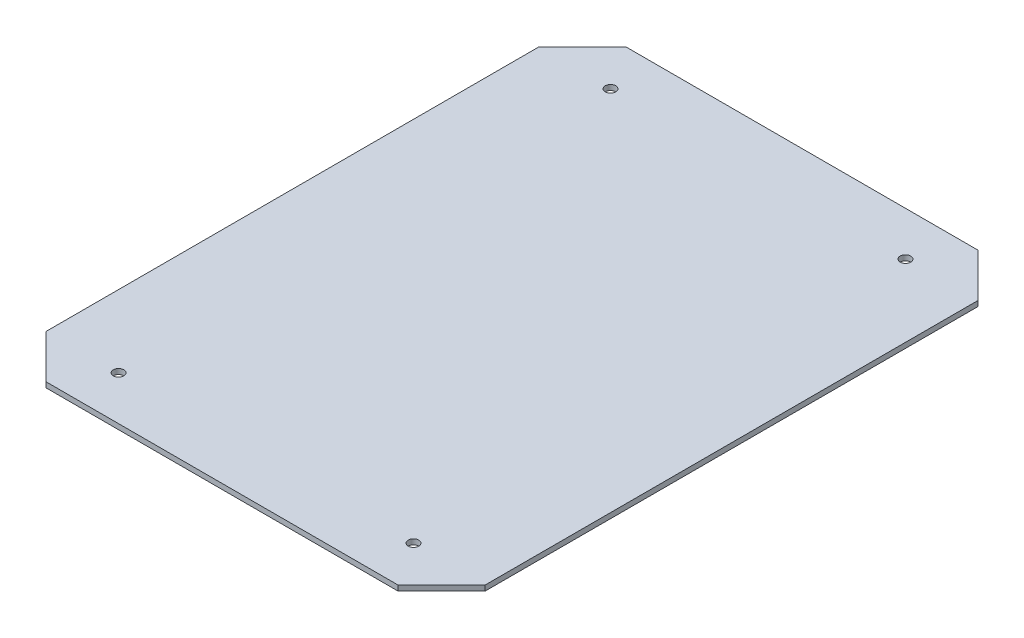
ISO-10303-21;
HEADER;
FILE_DESCRIPTION(('STEP AP214'),'2;1');
FILE_NAME('part.step','',(''),(''),'','','');
FILE_SCHEMA(('AUTOMOTIVE_DESIGN { 1 0 10303 214 1 1 1 1 }'));
ENDSEC;
DATA;
#1=APPLICATION_CONTEXT('core data for automotive mechanical design processes');
#2=APPLICATION_PROTOCOL_DEFINITION('international standard','automotive_design',2000,#1);
#3=PRODUCT_CONTEXT('',#1,'mechanical');
#4=PRODUCT('Part','Part','',(#3));
#5=PRODUCT_RELATED_PRODUCT_CATEGORY('part','',(#4));
#6=PRODUCT_DEFINITION_FORMATION('','',#4);
#7=PRODUCT_DEFINITION_CONTEXT('part definition',#1,'design');
#8=PRODUCT_DEFINITION('design','',#6,#7);
#9=PRODUCT_DEFINITION_SHAPE('','',#8);
#10=(LENGTH_UNIT() NAMED_UNIT(*) SI_UNIT(.MILLI.,.METRE.));
#11=(NAMED_UNIT(*) PLANE_ANGLE_UNIT() SI_UNIT($,.RADIAN.));
#12=(NAMED_UNIT(*) SI_UNIT($,.STERADIAN.) SOLID_ANGLE_UNIT());
#13=UNCERTAINTY_MEASURE_WITH_UNIT(LENGTH_MEASURE(1.E-05),#10,'distance_accuracy_value','');
#14=(GEOMETRIC_REPRESENTATION_CONTEXT(3) GLOBAL_UNCERTAINTY_ASSIGNED_CONTEXT((#13)) GLOBAL_UNIT_ASSIGNED_CONTEXT((#10,
#11,#12)) REPRESENTATION_CONTEXT('',''));
#15=CARTESIAN_POINT('',(0.,0.,0.));
#16=DIRECTION('',(0.,0.,1.));
#17=DIRECTION('',(1.,0.,0.));
#18=AXIS2_PLACEMENT_3D('',#15,#16,#17);
#19=CARTESIAN_POINT('',(124.748737341529,3.,140.));
#20=DIRECTION('',(-0.707106781186548,0.,-0.707106781186547));
#21=DIRECTION('',(-0.707106781186547,0.,0.707106781186548));
#22=AXIS2_PLACEMENT_3D('',#19,#20,#21);
#23=PLANE('',#22);
#24=DIRECTION('',(0.707106781186547,0.,-0.707106781186548));
#25=VECTOR('',#24,1.);
#26=CARTESIAN_POINT('',(124.748737341529,0.,140.));
#27=LINE('',#26,#25);
#28=CARTESIAN_POINT('',(100.,0.,164.748737341529));
#29=VERTEX_POINT('',#28);
#30=CARTESIAN_POINT('',(124.748737341529,0.,140.));
#31=VERTEX_POINT('',#30);
#32=EDGE_CURVE('E129',#29,#31,#27,.T.);
#33=ORIENTED_EDGE('',*,*,#32,.T.);
#34=DIRECTION('',(0.,-1.,0.));
#35=VECTOR('',#34,1.);
#36=CARTESIAN_POINT('',(124.748737341529,3.,140.));
#37=LINE('',#36,#35);
#38=CARTESIAN_POINT('',(124.748737341529,3.,140.));
#39=VERTEX_POINT('',#38);
#40=EDGE_CURVE('E11',#39,#31,#37,.T.);
#41=ORIENTED_EDGE('',*,*,#40,.F.);
#42=DIRECTION('',(0.707106781186547,0.,-0.707106781186548));
#43=VECTOR('',#42,1.);
#44=CARTESIAN_POINT('',(124.748737341529,3.,140.));
#45=LINE('',#44,#43);
#46=CARTESIAN_POINT('',(100.,3.,164.748737341529));
#47=VERTEX_POINT('',#46);
#48=EDGE_CURVE('E144',#47,#39,#45,.T.);
#49=ORIENTED_EDGE('',*,*,#48,.F.);
#50=DIRECTION('',(0.,-1.,0.));
#51=VECTOR('',#50,1.);
#52=CARTESIAN_POINT('',(100.,3.,164.748737341529));
#53=LINE('',#52,#51);
#54=EDGE_CURVE('E125',#47,#29,#53,.T.);
#55=ORIENTED_EDGE('',*,*,#54,.T.);
#56=EDGE_LOOP('',(#33,#41,#49,#55));
#57=FACE_BOUND('',#56,.T.);
#58=ADVANCED_FACE('F33',(#57),#23,.F.);
#59=CARTESIAN_POINT('',(124.748737341529,3.,-140.));
#60=DIRECTION('',(-1.,0.,0.));
#61=DIRECTION('',(0.,0.,1.));
#62=AXIS2_PLACEMENT_3D('',#59,#60,#61);
#63=PLANE('',#62);
#64=DIRECTION('',(0.,0.,-1.));
#65=VECTOR('',#64,1.);
#66=CARTESIAN_POINT('',(124.748737341529,0.,-140.));
#67=LINE('',#66,#65);
#68=CARTESIAN_POINT('',(124.748737341529,0.,-140.));
#69=VERTEX_POINT('',#68);
#70=EDGE_CURVE('E132',#31,#69,#67,.T.);
#71=ORIENTED_EDGE('',*,*,#70,.T.);
#72=DIRECTION('',(0.,-1.,0.));
#73=VECTOR('',#72,1.);
#74=CARTESIAN_POINT('',(124.748737341529,3.,-140.));
#75=LINE('',#74,#73);
#76=CARTESIAN_POINT('',(124.748737341529,3.,-140.));
#77=VERTEX_POINT('',#76);
#78=EDGE_CURVE('E41',#77,#69,#75,.T.);
#79=ORIENTED_EDGE('',*,*,#78,.F.);
#80=DIRECTION('',(0.,0.,-1.));
#81=VECTOR('',#80,1.);
#82=CARTESIAN_POINT('',(124.748737341529,3.,-140.));
#83=LINE('',#82,#81);
#84=EDGE_CURVE('E92',#39,#77,#83,.T.);
#85=ORIENTED_EDGE('',*,*,#84,.F.);
#86=ORIENTED_EDGE('',*,*,#40,.T.);
#87=EDGE_LOOP('',(#71,#79,#85,#86));
#88=FACE_BOUND('',#87,.T.);
#89=ADVANCED_FACE('F229',(#88),#63,.F.);
#90=CARTESIAN_POINT('',(99.9999999999999,3.,-164.748737341529));
#91=DIRECTION('',(-0.707106781186547,0.,0.707106781186548));
#92=DIRECTION('',(0.707106781186548,0.,0.707106781186547));
#93=AXIS2_PLACEMENT_3D('',#90,#91,#92);
#94=PLANE('',#93);
#95=DIRECTION('',(-0.707106781186548,0.,-0.707106781186547));
#96=VECTOR('',#95,1.);
#97=CARTESIAN_POINT('',(99.9999999999999,0.,-164.748737341529));
#98=LINE('',#97,#96);
#99=CARTESIAN_POINT('',(99.9999999999999,0.,-164.748737341529));
#100=VERTEX_POINT('',#99);
#101=EDGE_CURVE('E135',#69,#100,#98,.T.);
#102=ORIENTED_EDGE('',*,*,#101,.T.);
#103=DIRECTION('',(0.,-1.,0.));
#104=VECTOR('',#103,1.);
#105=CARTESIAN_POINT('',(99.9999999999999,3.,-164.748737341529));
#106=LINE('',#105,#104);
#107=CARTESIAN_POINT('',(99.9999999999999,3.,-164.748737341529));
#108=VERTEX_POINT('',#107);
#109=EDGE_CURVE('E151',#108,#100,#106,.T.);
#110=ORIENTED_EDGE('',*,*,#109,.F.);
#111=DIRECTION('',(-0.707106781186548,0.,-0.707106781186547));
#112=VECTOR('',#111,1.);
#113=CARTESIAN_POINT('',(99.9999999999999,3.,-164.748737341529));
#114=LINE('',#113,#112);
#115=EDGE_CURVE('E159',#77,#108,#114,.T.);
#116=ORIENTED_EDGE('',*,*,#115,.F.);
#117=ORIENTED_EDGE('',*,*,#78,.T.);
#118=EDGE_LOOP('',(#102,#110,#116,#117));
#119=FACE_BOUND('',#118,.T.);
#120=ADVANCED_FACE('F157',(#119),#94,.F.);
#121=CARTESIAN_POINT('',(-100.,3.,-164.748737341529));
#122=DIRECTION('',(0.,0.,1.));
#123=DIRECTION('',(1.,0.,0.));
#124=AXIS2_PLACEMENT_3D('',#121,#122,#123);
#125=PLANE('',#124);
#126=DIRECTION('',(-1.,0.,0.));
#127=VECTOR('',#126,1.);
#128=CARTESIAN_POINT('',(-100.,0.,-164.748737341529));
#129=LINE('',#128,#127);
#130=CARTESIAN_POINT('',(-100.,0.,-164.748737341529));
#131=VERTEX_POINT('',#130);
#132=EDGE_CURVE('E137',#100,#131,#129,.T.);
#133=ORIENTED_EDGE('',*,*,#132,.T.);
#134=DIRECTION('',(0.,-1.,0.));
#135=VECTOR('',#134,1.);
#136=CARTESIAN_POINT('',(-100.,3.,-164.748737341529));
#137=LINE('',#136,#135);
#138=CARTESIAN_POINT('',(-100.,3.,-164.748737341529));
#139=VERTEX_POINT('',#138);
#140=EDGE_CURVE('E148',#139,#131,#137,.T.);
#141=ORIENTED_EDGE('',*,*,#140,.F.);
#142=DIRECTION('',(-1.,0.,0.));
#143=VECTOR('',#142,1.);
#144=CARTESIAN_POINT('',(-100.,3.,-164.748737341529));
#145=LINE('',#144,#143);
#146=EDGE_CURVE('E171',#108,#139,#145,.T.);
#147=ORIENTED_EDGE('',*,*,#146,.F.);
#148=ORIENTED_EDGE('',*,*,#109,.T.);
#149=EDGE_LOOP('',(#133,#141,#147,#148));
#150=FACE_BOUND('',#149,.T.);
#151=ADVANCED_FACE('F167',(#150),#125,.F.);
#152=CARTESIAN_POINT('',(-124.748737341529,3.,-140.));
#153=DIRECTION('',(0.707106781186549,0.,0.707106781186546));
#154=DIRECTION('',(0.707106781186546,0.,-0.707106781186549));
#155=AXIS2_PLACEMENT_3D('',#152,#153,#154);
#156=PLANE('',#155);
#157=DIRECTION('',(-0.707106781186546,0.,0.707106781186549));
#158=VECTOR('',#157,1.);
#159=CARTESIAN_POINT('',(-124.748737341529,0.,-140.));
#160=LINE('',#159,#158);
#161=CARTESIAN_POINT('',(-124.748737341529,0.,-140.));
#162=VERTEX_POINT('',#161);
#163=EDGE_CURVE('E139',#131,#162,#160,.T.);
#164=ORIENTED_EDGE('',*,*,#163,.T.);
#165=DIRECTION('',(0.,-1.,0.));
#166=VECTOR('',#165,1.);
#167=CARTESIAN_POINT('',(-124.748737341529,3.,-140.));
#168=LINE('',#167,#166);
#169=CARTESIAN_POINT('',(-124.748737341529,3.,-140.));
#170=VERTEX_POINT('',#169);
#171=EDGE_CURVE('E120',#170,#162,#168,.T.);
#172=ORIENTED_EDGE('',*,*,#171,.F.);
#173=DIRECTION('',(-0.707106781186546,0.,0.707106781186549));
#174=VECTOR('',#173,1.);
#175=CARTESIAN_POINT('',(-124.748737341529,3.,-140.));
#176=LINE('',#175,#174);
#177=EDGE_CURVE('E111',#139,#170,#176,.T.);
#178=ORIENTED_EDGE('',*,*,#177,.F.);
#179=ORIENTED_EDGE('',*,*,#140,.T.);
#180=EDGE_LOOP('',(#164,#172,#178,#179));
#181=FACE_BOUND('',#180,.T.);
#182=ADVANCED_FACE('F170',(#181),#156,.F.);
#183=CARTESIAN_POINT('',(-124.748737341529,3.,140.));
#184=DIRECTION('',(1.,0.,0.));
#185=DIRECTION('',(0.,0.,-1.));
#186=AXIS2_PLACEMENT_3D('',#183,#184,#185);
#187=PLANE('',#186);
#188=DIRECTION('',(0.,0.,1.));
#189=VECTOR('',#188,1.);
#190=CARTESIAN_POINT('',(-124.748737341529,0.,140.));
#191=LINE('',#190,#189);
#192=CARTESIAN_POINT('',(-124.748737341529,0.,140.));
#193=VERTEX_POINT('',#192);
#194=EDGE_CURVE('E119',#162,#193,#191,.T.);
#195=ORIENTED_EDGE('',*,*,#194,.T.);
#196=DIRECTION('',(0.,-1.,0.));
#197=VECTOR('',#196,1.);
#198=CARTESIAN_POINT('',(-124.748737341529,3.,140.));
#199=LINE('',#198,#197);
#200=CARTESIAN_POINT('',(-124.748737341529,3.,140.));
#201=VERTEX_POINT('',#200);
#202=EDGE_CURVE('E116',#201,#193,#199,.T.);
#203=ORIENTED_EDGE('',*,*,#202,.F.);
#204=DIRECTION('',(0.,0.,1.));
#205=VECTOR('',#204,1.);
#206=CARTESIAN_POINT('',(-124.748737341529,3.,140.));
#207=LINE('',#206,#205);
#208=EDGE_CURVE('E105',#170,#201,#207,.T.);
#209=ORIENTED_EDGE('',*,*,#208,.F.);
#210=ORIENTED_EDGE('',*,*,#171,.T.);
#211=EDGE_LOOP('',(#195,#203,#209,#210));
#212=FACE_BOUND('',#211,.T.);
#213=ADVANCED_FACE('F117',(#212),#187,.F.);
#214=CARTESIAN_POINT('',(-100.,3.,164.748737341529));
#215=DIRECTION('',(0.707106781186548,0.,-0.707106781186548));
#216=DIRECTION('',(-0.707106781186548,0.,-0.707106781186548));
#217=AXIS2_PLACEMENT_3D('',#214,#215,#216);
#218=PLANE('',#217);
#219=DIRECTION('',(0.707106781186547,0.,0.707106781186547));
#220=VECTOR('',#219,1.);
#221=CARTESIAN_POINT('',(-100.,0.,164.748737341529));
#222=LINE('',#221,#220);
#223=CARTESIAN_POINT('',(-100.,0.,164.748737341529));
#224=VERTEX_POINT('',#223);
#225=EDGE_CURVE('E78',#193,#224,#222,.T.);
#226=ORIENTED_EDGE('',*,*,#225,.T.);
#227=DIRECTION('',(0.,-1.,0.));
#228=VECTOR('',#227,1.);
#229=CARTESIAN_POINT('',(-100.,3.,164.748737341529));
#230=LINE('',#229,#228);
#231=CARTESIAN_POINT('',(-100.,3.,164.748737341529));
#232=VERTEX_POINT('',#231);
#233=EDGE_CURVE('E121',#232,#224,#230,.T.);
#234=ORIENTED_EDGE('',*,*,#233,.F.);
#235=DIRECTION('',(0.707106781186547,0.,0.707106781186547));
#236=VECTOR('',#235,1.);
#237=CARTESIAN_POINT('',(-100.,3.,164.748737341529));
#238=LINE('',#237,#236);
#239=EDGE_CURVE('E109',#201,#232,#238,.T.);
#240=ORIENTED_EDGE('',*,*,#239,.F.);
#241=ORIENTED_EDGE('',*,*,#202,.T.);
#242=EDGE_LOOP('',(#226,#234,#240,#241));
#243=FACE_BOUND('',#242,.T.);
#244=ADVANCED_FACE('F123',(#243),#218,.F.);
#245=CARTESIAN_POINT('',(100.,3.,164.748737341529));
#246=DIRECTION('',(0.,0.,-1.));
#247=DIRECTION('',(-1.,0.,0.));
#248=AXIS2_PLACEMENT_3D('',#245,#246,#247);
#249=PLANE('',#248);
#250=DIRECTION('',(1.,0.,0.));
#251=VECTOR('',#250,1.);
#252=CARTESIAN_POINT('',(100.,0.,164.748737341529));
#253=LINE('',#252,#251);
#254=EDGE_CURVE('E84',#224,#29,#253,.T.);
#255=ORIENTED_EDGE('',*,*,#254,.T.);
#256=ORIENTED_EDGE('',*,*,#54,.F.);
#257=DIRECTION('',(1.,0.,0.));
#258=VECTOR('',#257,1.);
#259=CARTESIAN_POINT('',(100.,3.,164.748737341529));
#260=LINE('',#259,#258);
#261=EDGE_CURVE('E49',#232,#47,#260,.T.);
#262=ORIENTED_EDGE('',*,*,#261,.F.);
#263=ORIENTED_EDGE('',*,*,#233,.T.);
#264=EDGE_LOOP('',(#255,#256,#262,#263));
#265=FACE_BOUND('',#264,.T.);
#266=ADVANCED_FACE('F213',(#265),#249,.F.);
#267=CARTESIAN_POINT('',(0.,3.,0.));
#268=DIRECTION('',(0.,-1.,0.));
#269=DIRECTION('',(0.,0.,-1.));
#270=AXIS2_PLACEMENT_3D('',#267,#268,#269);
#271=PLANE('',#270);
#272=CARTESIAN_POINT('',(-83.7867965644037,3.,139.748737341529));
#273=DIRECTION('',(0.,1.,0.));
#274=DIRECTION('',(0.,0.,-1.));
#275=AXIS2_PLACEMENT_3D('',#272,#273,#274);
#276=CIRCLE('',#275,3.00000000000001);
#277=CARTESIAN_POINT('',(-83.7867965644037,3.,136.748737341529));
#278=VERTEX_POINT('',#277);
#279=EDGE_CURVE('E183',#278,#278,#276,.T.);
#280=ORIENTED_EDGE('',*,*,#279,.F.);
#281=EDGE_LOOP('',(#280));
#282=FACE_BOUND('',#281,.T.);
#283=CARTESIAN_POINT('',(83.7867965644037,3.,139.748737341529));
#284=DIRECTION('',(0.,1.,0.));
#285=DIRECTION('',(0.,0.,1.));
#286=AXIS2_PLACEMENT_3D('',#283,#284,#285);
#287=CIRCLE('',#286,3.00000000000001);
#288=CARTESIAN_POINT('',(83.7867965644037,3.,142.748737341529));
#289=VERTEX_POINT('',#288);
#290=EDGE_CURVE('E189',#289,#289,#287,.T.);
#291=ORIENTED_EDGE('',*,*,#290,.F.);
#292=EDGE_LOOP('',(#291));
#293=FACE_BOUND('',#292,.T.);
#294=CARTESIAN_POINT('',(83.7867965644036,3.,-139.748737341529));
#295=DIRECTION('',(0.,1.,0.));
#296=DIRECTION('',(0.,0.,-1.));
#297=AXIS2_PLACEMENT_3D('',#294,#295,#296);
#298=CIRCLE('',#297,3.00000000000001);
#299=CARTESIAN_POINT('',(83.7867965644036,3.,-142.748737341529));
#300=VERTEX_POINT('',#299);
#301=EDGE_CURVE('E195',#300,#300,#298,.T.);
#302=ORIENTED_EDGE('',*,*,#301,.F.);
#303=EDGE_LOOP('',(#302));
#304=FACE_BOUND('',#303,.T.);
#305=CARTESIAN_POINT('',(-83.7867965644037,3.,-139.748737341529));
#306=DIRECTION('',(0.,1.,0.));
#307=DIRECTION('',(0.,0.,1.));
#308=AXIS2_PLACEMENT_3D('',#305,#306,#307);
#309=CIRCLE('',#308,3.00000000000001);
#310=CARTESIAN_POINT('',(-83.7867965644037,3.,-136.748737341529));
#311=VERTEX_POINT('',#310);
#312=EDGE_CURVE('E177',#311,#311,#309,.T.);
#313=ORIENTED_EDGE('',*,*,#312,.F.);
#314=EDGE_LOOP('',(#313));
#315=FACE_BOUND('',#314,.T.);
#316=ORIENTED_EDGE('',*,*,#48,.T.);
#317=ORIENTED_EDGE('',*,*,#84,.T.);
#318=ORIENTED_EDGE('',*,*,#115,.T.);
#319=ORIENTED_EDGE('',*,*,#146,.T.);
#320=ORIENTED_EDGE('',*,*,#177,.T.);
#321=ORIENTED_EDGE('',*,*,#208,.T.);
#322=ORIENTED_EDGE('',*,*,#239,.T.);
#323=ORIENTED_EDGE('',*,*,#261,.T.);
#324=EDGE_LOOP('',(#316,#317,#318,#319,#320,#321,#322,#323));
#325=FACE_BOUND('',#324,.T.);
#326=ADVANCED_FACE('F107',(#282,#293,#304,#315,#325),#271,.F.);
#327=CARTESIAN_POINT('',(0.,0.,0.));
#328=DIRECTION('',(0.,-1.,0.));
#329=DIRECTION('',(0.,0.,-1.));
#330=AXIS2_PLACEMENT_3D('',#327,#328,#329);
#331=PLANE('',#330);
#332=CARTESIAN_POINT('',(-83.7867965644037,0.,139.748737341529));
#333=DIRECTION('',(0.,1.,0.));
#334=DIRECTION('',(0.,0.,-1.));
#335=AXIS2_PLACEMENT_3D('',#332,#333,#334);
#336=CIRCLE('',#335,3.00000000000001);
#337=CARTESIAN_POINT('',(-83.7867965644037,0.,136.748737341529));
#338=VERTEX_POINT('',#337);
#339=EDGE_CURVE('E186',#338,#338,#336,.T.);
#340=ORIENTED_EDGE('',*,*,#339,.T.);
#341=EDGE_LOOP('',(#340));
#342=FACE_BOUND('',#341,.T.);
#343=CARTESIAN_POINT('',(83.7867965644037,0.,139.748737341529));
#344=DIRECTION('',(0.,1.,0.));
#345=DIRECTION('',(0.,0.,1.));
#346=AXIS2_PLACEMENT_3D('',#343,#344,#345);
#347=CIRCLE('',#346,3.00000000000001);
#348=CARTESIAN_POINT('',(83.7867965644037,0.,142.748737341529));
#349=VERTEX_POINT('',#348);
#350=EDGE_CURVE('E192',#349,#349,#347,.T.);
#351=ORIENTED_EDGE('',*,*,#350,.T.);
#352=EDGE_LOOP('',(#351));
#353=FACE_BOUND('',#352,.T.);
#354=CARTESIAN_POINT('',(83.7867965644036,0.,-139.748737341529));
#355=DIRECTION('',(0.,1.,0.));
#356=DIRECTION('',(0.,0.,-1.));
#357=AXIS2_PLACEMENT_3D('',#354,#355,#356);
#358=CIRCLE('',#357,3.00000000000001);
#359=CARTESIAN_POINT('',(83.7867965644036,0.,-142.748737341529));
#360=VERTEX_POINT('',#359);
#361=EDGE_CURVE('E180',#360,#360,#358,.T.);
#362=ORIENTED_EDGE('',*,*,#361,.T.);
#363=EDGE_LOOP('',(#362));
#364=FACE_BOUND('',#363,.T.);
#365=CARTESIAN_POINT('',(-83.7867965644037,0.,-139.748737341529));
#366=DIRECTION('',(0.,1.,0.));
#367=DIRECTION('',(0.,0.,1.));
#368=AXIS2_PLACEMENT_3D('',#365,#366,#367);
#369=CIRCLE('',#368,3.00000000000001);
#370=CARTESIAN_POINT('',(-83.7867965644037,0.,-136.748737341529));
#371=VERTEX_POINT('',#370);
#372=EDGE_CURVE('E133',#371,#371,#369,.T.);
#373=ORIENTED_EDGE('',*,*,#372,.T.);
#374=EDGE_LOOP('',(#373));
#375=FACE_BOUND('',#374,.T.);
#376=ORIENTED_EDGE('',*,*,#32,.F.);
#377=ORIENTED_EDGE('',*,*,#254,.F.);
#378=ORIENTED_EDGE('',*,*,#225,.F.);
#379=ORIENTED_EDGE('',*,*,#194,.F.);
#380=ORIENTED_EDGE('',*,*,#163,.F.);
#381=ORIENTED_EDGE('',*,*,#132,.F.);
#382=ORIENTED_EDGE('',*,*,#101,.F.);
#383=ORIENTED_EDGE('',*,*,#70,.F.);
#384=EDGE_LOOP('',(#376,#377,#378,#379,#380,#381,#382,#383));
#385=FACE_BOUND('',#384,.T.);
#386=ADVANCED_FACE('F163',(#342,#353,#364,#375,#385),#331,.T.);
#387=CARTESIAN_POINT('',(-83.7867965644037,0.,-139.748737341529));
#388=DIRECTION('',(0.,1.,0.));
#389=DIRECTION('',(0.,0.,1.));
#390=AXIS2_PLACEMENT_3D('',#387,#388,#389);
#391=CYLINDRICAL_SURFACE('',#390,3.00000000000001);
#392=ORIENTED_EDGE('',*,*,#372,.F.);
#393=EDGE_LOOP('',(#392));
#394=FACE_BOUND('',#393,.T.);
#395=ORIENTED_EDGE('',*,*,#312,.T.);
#396=EDGE_LOOP('',(#395));
#397=FACE_BOUND('',#396,.T.);
#398=ADVANCED_FACE('F207',(#394,#397),#391,.F.);
#399=CARTESIAN_POINT('',(83.7867965644036,0.,-139.748737341529));
#400=DIRECTION('',(0.,1.,0.));
#401=DIRECTION('',(0.,0.,1.));
#402=AXIS2_PLACEMENT_3D('',#399,#400,#401);
#403=CYLINDRICAL_SURFACE('',#402,3.00000000000001);
#404=ORIENTED_EDGE('',*,*,#361,.F.);
#405=EDGE_LOOP('',(#404));
#406=FACE_BOUND('',#405,.T.);
#407=ORIENTED_EDGE('',*,*,#301,.T.);
#408=EDGE_LOOP('',(#407));
#409=FACE_BOUND('',#408,.T.);
#410=ADVANCED_FACE('F203',(#406,#409),#403,.F.);
#411=CARTESIAN_POINT('',(83.7867965644037,0.,139.748737341529));
#412=DIRECTION('',(0.,1.,0.));
#413=DIRECTION('',(0.,0.,1.));
#414=AXIS2_PLACEMENT_3D('',#411,#412,#413);
#415=CYLINDRICAL_SURFACE('',#414,3.00000000000001);
#416=ORIENTED_EDGE('',*,*,#350,.F.);
#417=EDGE_LOOP('',(#416));
#418=FACE_BOUND('',#417,.T.);
#419=ORIENTED_EDGE('',*,*,#290,.T.);
#420=EDGE_LOOP('',(#419));
#421=FACE_BOUND('',#420,.T.);
#422=ADVANCED_FACE('F206',(#418,#421),#415,.F.);
#423=CARTESIAN_POINT('',(-83.7867965644037,0.,139.748737341529));
#424=DIRECTION('',(0.,1.,0.));
#425=DIRECTION('',(0.,0.,1.));
#426=AXIS2_PLACEMENT_3D('',#423,#424,#425);
#427=CYLINDRICAL_SURFACE('',#426,3.00000000000001);
#428=ORIENTED_EDGE('',*,*,#339,.F.);
#429=EDGE_LOOP('',(#428));
#430=FACE_BOUND('',#429,.T.);
#431=ORIENTED_EDGE('',*,*,#279,.T.);
#432=EDGE_LOOP('',(#431));
#433=FACE_BOUND('',#432,.T.);
#434=ADVANCED_FACE('F305',(#430,#433),#427,.F.);
#435=CLOSED_SHELL('',(#58,#89,#120,#151,#182,#213,#244,#266,#326,#386,#398,#410,#422,#434));
#436=MANIFOLD_SOLID_BREP('B2',#435);
#437=ADVANCED_BREP_SHAPE_REPRESENTATION('',(#18,#436),#14);
#438=SHAPE_DEFINITION_REPRESENTATION(#9,#437);
ENDSEC;
END-ISO-10303-21;
